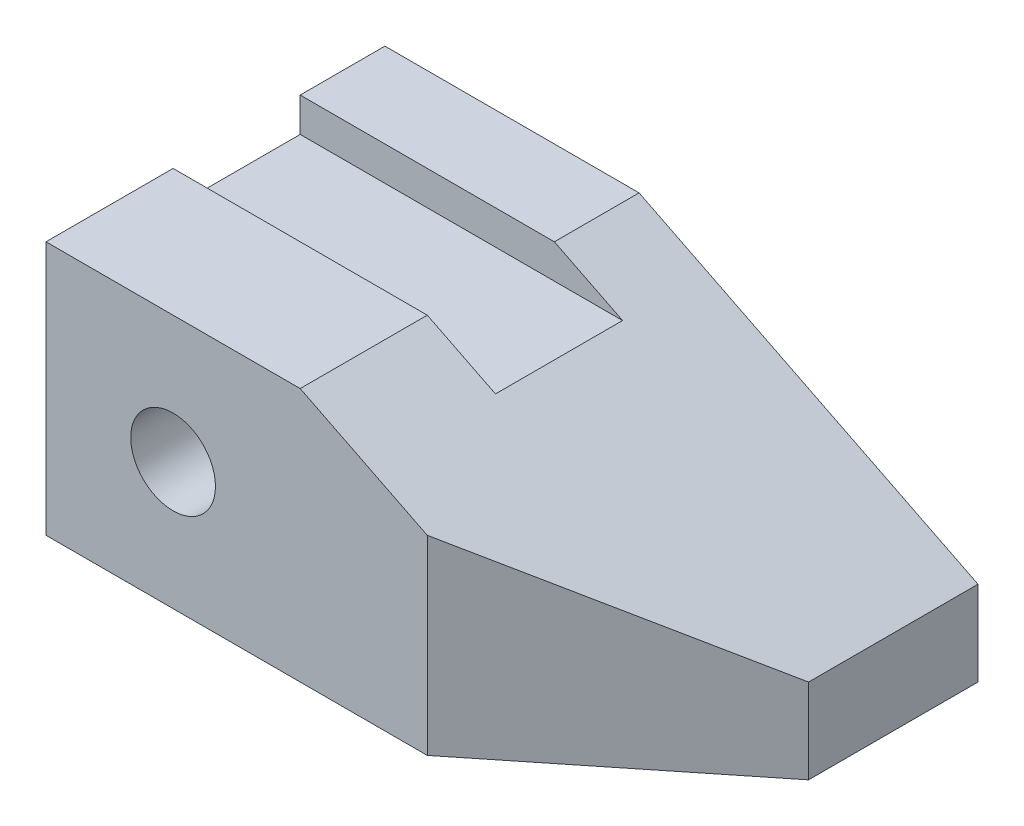
ISO-10303-21;
HEADER;
FILE_DESCRIPTION(('STEP AP214'),'2;1');
FILE_NAME('part.step','',(''),(''),'','','');
FILE_SCHEMA(('AUTOMOTIVE_DESIGN { 1 0 10303 214 1 1 1 1 }'));
ENDSEC;
DATA;
#1=APPLICATION_CONTEXT('core data for automotive mechanical design processes');
#2=APPLICATION_PROTOCOL_DEFINITION('international standard','automotive_design',2000,#1);
#3=PRODUCT_CONTEXT('',#1,'mechanical');
#4=PRODUCT('Part','Part','',(#3));
#5=PRODUCT_RELATED_PRODUCT_CATEGORY('part','',(#4));
#6=PRODUCT_DEFINITION_FORMATION('','',#4);
#7=PRODUCT_DEFINITION_CONTEXT('part definition',#1,'design');
#8=PRODUCT_DEFINITION('design','',#6,#7);
#9=PRODUCT_DEFINITION_SHAPE('','',#8);
#10=(LENGTH_UNIT() NAMED_UNIT(*) SI_UNIT(.MILLI.,.METRE.));
#11=(NAMED_UNIT(*) PLANE_ANGLE_UNIT() SI_UNIT($,.RADIAN.));
#12=(NAMED_UNIT(*) SI_UNIT($,.STERADIAN.) SOLID_ANGLE_UNIT());
#13=UNCERTAINTY_MEASURE_WITH_UNIT(LENGTH_MEASURE(1.E-05),#10,'distance_accuracy_value','');
#14=(GEOMETRIC_REPRESENTATION_CONTEXT(3) GLOBAL_UNCERTAINTY_ASSIGNED_CONTEXT((#13)) GLOBAL_UNIT_ASSIGNED_CONTEXT((#10,
#11,#12)) REPRESENTATION_CONTEXT('',''));
#15=CARTESIAN_POINT('',(0.,0.,0.));
#16=DIRECTION('',(0.,0.,1.));
#17=DIRECTION('',(1.,0.,0.));
#18=AXIS2_PLACEMENT_3D('',#15,#16,#17);
#19=CARTESIAN_POINT('',(0.,30.,0.));
#20=DIRECTION('',(0.,-1.,0.));
#21=DIRECTION('',(0.,0.,-1.));
#22=AXIS2_PLACEMENT_3D('',#19,#20,#21);
#23=PLANE('',#22);
#24=DIRECTION('',(0.,0.,1.));
#25=VECTOR('',#24,1.);
#26=CARTESIAN_POINT('',(0.,30.,0.));
#27=LINE('',#26,#25);
#28=CARTESIAN_POINT('',(0.,30.,-40.));
#29=VERTEX_POINT('',#28);
#30=CARTESIAN_POINT('',(0.,30.,-30.));
#31=VERTEX_POINT('',#30);
#32=EDGE_CURVE('E179',#29,#31,#27,.T.);
#33=ORIENTED_EDGE('',*,*,#32,.T.);
#34=DIRECTION('',(-1.,0.,0.));
#35=VECTOR('',#34,1.);
#36=CARTESIAN_POINT('',(70.,30.,-30.));
#37=LINE('',#36,#35);
#38=CARTESIAN_POINT('',(30.,30.,-30.));
#39=VERTEX_POINT('',#38);
#40=EDGE_CURVE('E131',#39,#31,#37,.T.);
#41=ORIENTED_EDGE('',*,*,#40,.F.);
#42=DIRECTION('',(0.,0.,1.));
#43=VECTOR('',#42,1.);
#44=CARTESIAN_POINT('',(30.,30.,-40.));
#45=LINE('',#44,#43);
#46=CARTESIAN_POINT('',(30.,30.,-40.));
#47=VERTEX_POINT('',#46);
#48=EDGE_CURVE('E175',#47,#39,#45,.T.);
#49=ORIENTED_EDGE('',*,*,#48,.F.);
#50=DIRECTION('',(-1.,0.,0.));
#51=VECTOR('',#50,1.);
#52=CARTESIAN_POINT('',(0.,30.,-40.));
#53=LINE('',#52,#51);
#54=EDGE_CURVE('E187',#47,#29,#53,.T.);
#55=ORIENTED_EDGE('',*,*,#54,.T.);
#56=EDGE_LOOP('',(#33,#41,#49,#55));
#57=FACE_BOUND('',#56,.T.);
#58=ADVANCED_FACE('F39',(#57),#23,.F.);
#59=CARTESIAN_POINT('',(0.,30.,0.));
#60=DIRECTION('',(1.,0.,0.));
#61=DIRECTION('',(0.,0.,-1.));
#62=AXIS2_PLACEMENT_3D('',#59,#60,#61);
#63=PLANE('',#62);
#64=DIRECTION('',(0.,0.,1.));
#65=VECTOR('',#64,1.);
#66=CARTESIAN_POINT('',(0.,25.9754682816031,-30.));
#67=LINE('',#66,#65);
#68=CARTESIAN_POINT('',(0.,25.9754682816031,-30.));
#69=VERTEX_POINT('',#68);
#70=CARTESIAN_POINT('',(0.,25.9754682816031,-15.));
#71=VERTEX_POINT('',#70);
#72=EDGE_CURVE('E119',#69,#71,#67,.T.);
#73=ORIENTED_EDGE('',*,*,#72,.F.);
#74=DIRECTION('',(0.,-1.,0.));
#75=VECTOR('',#74,1.);
#76=CARTESIAN_POINT('',(0.,30.,-30.));
#77=LINE('',#76,#75);
#78=EDGE_CURVE('E128',#31,#69,#77,.T.);
#79=ORIENTED_EDGE('',*,*,#78,.F.);
#80=ORIENTED_EDGE('',*,*,#32,.F.);
#81=DIRECTION('',(0.,-1.,0.));
#82=VECTOR('',#81,1.);
#83=CARTESIAN_POINT('',(0.,30.,-40.));
#84=LINE('',#83,#82);
#85=CARTESIAN_POINT('',(0.,0.,-40.));
#86=VERTEX_POINT('',#85);
#87=EDGE_CURVE('E190',#29,#86,#84,.T.);
#88=ORIENTED_EDGE('',*,*,#87,.T.);
#89=DIRECTION('',(0.,0.,1.));
#90=VECTOR('',#89,1.);
#91=CARTESIAN_POINT('',(0.,0.,0.));
#92=LINE('',#91,#90);
#93=CARTESIAN_POINT('',(0.,0.,0.));
#94=VERTEX_POINT('',#93);
#95=EDGE_CURVE('E174',#86,#94,#92,.T.);
#96=ORIENTED_EDGE('',*,*,#95,.T.);
#97=DIRECTION('',(0.,-1.,0.));
#98=VECTOR('',#97,1.);
#99=CARTESIAN_POINT('',(0.,30.,0.));
#100=LINE('',#99,#98);
#101=CARTESIAN_POINT('',(0.,30.,0.));
#102=VERTEX_POINT('',#101);
#103=EDGE_CURVE('E211',#102,#94,#100,.T.);
#104=ORIENTED_EDGE('',*,*,#103,.F.);
#105=CARTESIAN_POINT('',(0.,30.,-15.));
#106=VERTEX_POINT('',#105);
#107=EDGE_CURVE('E183',#106,#102,#27,.T.);
#108=ORIENTED_EDGE('',*,*,#107,.F.);
#109=DIRECTION('',(0.,1.,0.));
#110=VECTOR('',#109,1.);
#111=CARTESIAN_POINT('',(0.,30.,-15.));
#112=LINE('',#111,#110);
#113=EDGE_CURVE('E125',#71,#106,#112,.T.);
#114=ORIENTED_EDGE('',*,*,#113,.F.);
#115=EDGE_LOOP('',(#73,#79,#80,#88,#96,#104,#108,#114));
#116=FACE_BOUND('',#115,.T.);
#117=ADVANCED_FACE('F41',(#116),#63,.F.);
#118=CARTESIAN_POINT('',(0.,30.,0.));
#119=DIRECTION('',(0.,0.,-1.));
#120=DIRECTION('',(-1.,0.,0.));
#121=AXIS2_PLACEMENT_3D('',#118,#119,#120);
#122=PLANE('',#121);
#123=CARTESIAN_POINT('',(15.,15.,0.));
#124=DIRECTION('',(0.,0.,1.));
#125=DIRECTION('',(1.,0.,0.));
#126=AXIS2_PLACEMENT_3D('',#123,#124,#125);
#127=CIRCLE('',#126,5.);
#128=CARTESIAN_POINT('',(20.,15.,0.));
#129=VERTEX_POINT('',#128);
#130=EDGE_CURVE('E275',#129,#129,#127,.T.);
#131=ORIENTED_EDGE('',*,*,#130,.F.);
#132=EDGE_LOOP('',(#131));
#133=FACE_BOUND('',#132,.T.);
#134=DIRECTION('',(1.,0.,0.));
#135=VECTOR('',#134,1.);
#136=CARTESIAN_POINT('',(0.,0.,0.));
#137=LINE('',#136,#135);
#138=CARTESIAN_POINT('',(45.,0.,0.));
#139=VERTEX_POINT('',#138);
#140=EDGE_CURVE('E194',#94,#139,#137,.T.);
#141=ORIENTED_EDGE('',*,*,#140,.T.);
#142=DIRECTION('',(0.,-1.,0.));
#143=VECTOR('',#142,1.);
#144=CARTESIAN_POINT('',(45.,30.,0.));
#145=LINE('',#144,#143);
#146=CARTESIAN_POINT('',(45.,22.5,0.));
#147=VERTEX_POINT('',#146);
#148=EDGE_CURVE('E156',#147,#139,#145,.T.);
#149=ORIENTED_EDGE('',*,*,#148,.F.);
#150=DIRECTION('',(0.894427190999916,-0.447213595499958,0.));
#151=VECTOR('',#150,1.);
#152=CARTESIAN_POINT('',(30.,30.,0.));
#153=LINE('',#152,#151);
#154=CARTESIAN_POINT('',(30.,30.,0.));
#155=VERTEX_POINT('',#154);
#156=EDGE_CURVE('E159',#155,#147,#153,.T.);
#157=ORIENTED_EDGE('',*,*,#156,.F.);
#158=DIRECTION('',(1.,0.,0.));
#159=VECTOR('',#158,1.);
#160=CARTESIAN_POINT('',(0.,30.,0.));
#161=LINE('',#160,#159);
#162=EDGE_CURVE('E182',#102,#155,#161,.T.);
#163=ORIENTED_EDGE('',*,*,#162,.F.);
#164=ORIENTED_EDGE('',*,*,#103,.T.);
#165=EDGE_LOOP('',(#141,#149,#157,#163,#164));
#166=FACE_BOUND('',#165,.T.);
#167=ADVANCED_FACE('F233',(#133,#166),#122,.F.);
#168=CARTESIAN_POINT('',(70.,30.,0.));
#169=DIRECTION('',(-1.,0.,0.));
#170=DIRECTION('',(0.,0.,1.));
#171=AXIS2_PLACEMENT_3D('',#168,#169,#170);
#172=PLANE('',#171);
#173=DIRECTION('',(0.,0.,1.));
#174=VECTOR('',#173,1.);
#175=CARTESIAN_POINT('',(70.,10.,-40.));
#176=LINE('',#175,#174);
#177=CARTESIAN_POINT('',(70.,10.,-40.));
#178=VERTEX_POINT('',#177);
#179=CARTESIAN_POINT('',(70.,9.99999999999999,-20.));
#180=VERTEX_POINT('',#179);
#181=EDGE_CURVE('E170',#178,#180,#176,.T.);
#182=ORIENTED_EDGE('',*,*,#181,.T.);
#183=DIRECTION('',(0.,-1.,0.));
#184=VECTOR('',#183,1.);
#185=CARTESIAN_POINT('',(70.,30.,-20.));
#186=LINE('',#185,#184);
#187=CARTESIAN_POINT('',(70.,0.,-20.));
#188=VERTEX_POINT('',#187);
#189=EDGE_CURVE('E63',#180,#188,#186,.T.);
#190=ORIENTED_EDGE('',*,*,#189,.T.);
#191=DIRECTION('',(0.,0.,-1.));
#192=VECTOR('',#191,1.);
#193=CARTESIAN_POINT('',(70.,0.,0.));
#194=LINE('',#193,#192);
#195=CARTESIAN_POINT('',(70.,0.,-40.));
#196=VERTEX_POINT('',#195);
#197=EDGE_CURVE('E198',#188,#196,#194,.T.);
#198=ORIENTED_EDGE('',*,*,#197,.T.);
#199=DIRECTION('',(0.,-1.,0.));
#200=VECTOR('',#199,1.);
#201=CARTESIAN_POINT('',(70.,30.,-40.));
#202=LINE('',#201,#200);
#203=EDGE_CURVE('E207',#178,#196,#202,.T.);
#204=ORIENTED_EDGE('',*,*,#203,.F.);
#205=EDGE_LOOP('',(#182,#190,#198,#204));
#206=FACE_BOUND('',#205,.T.);
#207=ADVANCED_FACE('F244',(#206),#172,.F.);
#208=CARTESIAN_POINT('',(0.,30.,-40.));
#209=DIRECTION('',(0.,0.,1.));
#210=DIRECTION('',(1.,0.,0.));
#211=AXIS2_PLACEMENT_3D('',#208,#209,#210);
#212=PLANE('',#211);
#213=CARTESIAN_POINT('',(15.,15.,-40.));
#214=DIRECTION('',(0.,0.,1.));
#215=DIRECTION('',(1.,0.,0.));
#216=AXIS2_PLACEMENT_3D('',#213,#214,#215);
#217=CIRCLE('',#216,5.);
#218=CARTESIAN_POINT('',(20.,15.,-40.));
#219=VERTEX_POINT('',#218);
#220=EDGE_CURVE('E136',#219,#219,#217,.T.);
#221=ORIENTED_EDGE('',*,*,#220,.T.);
#222=EDGE_LOOP('',(#221));
#223=FACE_BOUND('',#222,.T.);
#224=ORIENTED_EDGE('',*,*,#54,.F.);
#225=DIRECTION('',(0.894427190999916,-0.447213595499958,0.));
#226=VECTOR('',#225,1.);
#227=CARTESIAN_POINT('',(30.,30.,-40.));
#228=LINE('',#227,#226);
#229=EDGE_CURVE('E162',#47,#178,#228,.T.);
#230=ORIENTED_EDGE('',*,*,#229,.T.);
#231=ORIENTED_EDGE('',*,*,#203,.T.);
#232=DIRECTION('',(-1.,0.,0.));
#233=VECTOR('',#232,1.);
#234=CARTESIAN_POINT('',(0.,0.,-40.));
#235=LINE('',#234,#233);
#236=EDGE_CURVE('E201',#196,#86,#235,.T.);
#237=ORIENTED_EDGE('',*,*,#236,.T.);
#238=ORIENTED_EDGE('',*,*,#87,.F.);
#239=EDGE_LOOP('',(#224,#230,#231,#237,#238));
#240=FACE_BOUND('',#239,.T.);
#241=ADVANCED_FACE('F247',(#223,#240),#212,.F.);
#242=CARTESIAN_POINT('',(30.,30.,-15.));
#243=VERTEX_POINT('',#242);
#244=EDGE_CURVE('E166',#243,#155,#45,.T.);
#245=ORIENTED_EDGE('',*,*,#244,.F.);
#246=DIRECTION('',(-1.,0.,0.));
#247=VECTOR('',#246,1.);
#248=CARTESIAN_POINT('',(70.,30.,-15.));
#249=LINE('',#248,#247);
#250=EDGE_CURVE('E148',#243,#106,#249,.T.);
#251=ORIENTED_EDGE('',*,*,#250,.T.);
#252=ORIENTED_EDGE('',*,*,#107,.T.);
#253=ORIENTED_EDGE('',*,*,#162,.T.);
#254=EDGE_LOOP('',(#245,#251,#252,#253));
#255=FACE_BOUND('',#254,.T.);
#256=ADVANCED_FACE('F227',(#255),#23,.F.);
#257=CARTESIAN_POINT('',(0.,0.,0.));
#258=DIRECTION('',(0.,-1.,0.));
#259=DIRECTION('',(0.,0.,-1.));
#260=AXIS2_PLACEMENT_3D('',#257,#258,#259);
#261=PLANE('',#260);
#262=DIRECTION('',(0.78086880944303,0.,-0.624695047554424));
#263=VECTOR('',#262,1.);
#264=CARTESIAN_POINT('',(45.,0.,0.));
#265=LINE('',#264,#263);
#266=EDGE_CURVE('E147',#139,#188,#265,.T.);
#267=ORIENTED_EDGE('',*,*,#266,.F.);
#268=ORIENTED_EDGE('',*,*,#140,.F.);
#269=ORIENTED_EDGE('',*,*,#95,.F.);
#270=ORIENTED_EDGE('',*,*,#236,.F.);
#271=ORIENTED_EDGE('',*,*,#197,.F.);
#272=EDGE_LOOP('',(#267,#268,#269,#270,#271));
#273=FACE_BOUND('',#272,.T.);
#274=ADVANCED_FACE('F240',(#273),#261,.T.);
#275=CARTESIAN_POINT('',(30.,30.,-40.));
#276=DIRECTION('',(-0.447213595499958,-0.894427190999916,0.));
#277=DIRECTION('',(0.894427190999916,-0.447213595499958,0.));
#278=AXIS2_PLACEMENT_3D('',#275,#276,#277);
#279=PLANE('',#278);
#280=ORIENTED_EDGE('',*,*,#48,.T.);
#281=DIRECTION('',(0.894427190999916,-0.447213595499958,0.));
#282=VECTOR('',#281,1.);
#283=CARTESIAN_POINT('',(30.,30.,-30.));
#284=LINE('',#283,#282);
#285=CARTESIAN_POINT('',(38.0490634367938,25.9754682816031,-30.));
#286=VERTEX_POINT('',#285);
#287=EDGE_CURVE('E11',#39,#286,#284,.T.);
#288=ORIENTED_EDGE('',*,*,#287,.T.);
#289=DIRECTION('',(0.,0.,1.));
#290=VECTOR('',#289,1.);
#291=CARTESIAN_POINT('',(38.0490634367938,25.9754682816031,-40.));
#292=LINE('',#291,#290);
#293=CARTESIAN_POINT('',(38.0490634367938,25.9754682816031,-15.));
#294=VERTEX_POINT('',#293);
#295=EDGE_CURVE('E122',#286,#294,#292,.T.);
#296=ORIENTED_EDGE('',*,*,#295,.T.);
#297=DIRECTION('',(-0.894427190999916,0.447213595499958,0.));
#298=VECTOR('',#297,1.);
#299=CARTESIAN_POINT('',(30.,30.,-15.));
#300=LINE('',#299,#298);
#301=EDGE_CURVE('E48',#294,#243,#300,.T.);
#302=ORIENTED_EDGE('',*,*,#301,.T.);
#303=ORIENTED_EDGE('',*,*,#244,.T.);
#304=ORIENTED_EDGE('',*,*,#156,.T.);
#305=DIRECTION('',(0.727392967453308,-0.363696483726654,-0.581914373962646));
#306=VECTOR('',#305,1.);
#307=CARTESIAN_POINT('',(52.010582010582,18.994708994709,-5.6084656084656));
#308=LINE('',#307,#306);
#309=EDGE_CURVE('E215',#147,#180,#308,.T.);
#310=ORIENTED_EDGE('',*,*,#309,.T.);
#311=ORIENTED_EDGE('',*,*,#181,.F.);
#312=ORIENTED_EDGE('',*,*,#229,.F.);
#313=EDGE_LOOP('',(#280,#288,#296,#302,#303,#304,#310,#311,#312));
#314=FACE_BOUND('',#313,.T.);
#315=ADVANCED_FACE('F223',(#314),#279,.F.);
#316=CARTESIAN_POINT('',(45.,30.,0.));
#317=DIRECTION('',(-0.624695047554424,0.,-0.78086880944303));
#318=DIRECTION('',(-0.78086880944303,0.,0.624695047554424));
#319=AXIS2_PLACEMENT_3D('',#316,#317,#318);
#320=PLANE('',#319);
#321=ORIENTED_EDGE('',*,*,#148,.T.);
#322=ORIENTED_EDGE('',*,*,#266,.T.);
#323=ORIENTED_EDGE('',*,*,#189,.F.);
#324=ORIENTED_EDGE('',*,*,#309,.F.);
#325=EDGE_LOOP('',(#321,#322,#323,#324));
#326=FACE_BOUND('',#325,.T.);
#327=ADVANCED_FACE('F295',(#326),#320,.F.);
#328=CARTESIAN_POINT('',(70.,30.,-30.));
#329=DIRECTION('',(0.,0.,-1.));
#330=DIRECTION('',(-1.,0.,0.));
#331=AXIS2_PLACEMENT_3D('',#328,#329,#330);
#332=PLANE('',#331);
#333=ORIENTED_EDGE('',*,*,#40,.T.);
#334=ORIENTED_EDGE('',*,*,#78,.T.);
#335=DIRECTION('',(-1.,0.,0.));
#336=VECTOR('',#335,1.);
#337=CARTESIAN_POINT('',(70.,25.9754682816031,-30.));
#338=LINE('',#337,#336);
#339=EDGE_CURVE('E115',#286,#69,#338,.T.);
#340=ORIENTED_EDGE('',*,*,#339,.F.);
#341=ORIENTED_EDGE('',*,*,#287,.F.);
#342=EDGE_LOOP('',(#333,#334,#340,#341));
#343=FACE_BOUND('',#342,.T.);
#344=ADVANCED_FACE('F129',(#343),#332,.F.);
#345=CARTESIAN_POINT('',(70.,30.,-15.));
#346=DIRECTION('',(0.,0.,1.));
#347=DIRECTION('',(1.,0.,0.));
#348=AXIS2_PLACEMENT_3D('',#345,#346,#347);
#349=PLANE('',#348);
#350=DIRECTION('',(-1.,0.,0.));
#351=VECTOR('',#350,1.);
#352=CARTESIAN_POINT('',(70.,25.9754682816031,-15.));
#353=LINE('',#352,#351);
#354=EDGE_CURVE('E55',#294,#71,#353,.T.);
#355=ORIENTED_EDGE('',*,*,#354,.T.);
#356=ORIENTED_EDGE('',*,*,#113,.T.);
#357=ORIENTED_EDGE('',*,*,#250,.F.);
#358=ORIENTED_EDGE('',*,*,#301,.F.);
#359=EDGE_LOOP('',(#355,#356,#357,#358));
#360=FACE_BOUND('',#359,.T.);
#361=ADVANCED_FACE('F288',(#360),#349,.F.);
#362=CARTESIAN_POINT('',(70.,25.9754682816031,-30.));
#363=DIRECTION('',(0.,-1.,0.));
#364=DIRECTION('',(0.,0.,-1.));
#365=AXIS2_PLACEMENT_3D('',#362,#363,#364);
#366=PLANE('',#365);
#367=ORIENTED_EDGE('',*,*,#339,.T.);
#368=ORIENTED_EDGE('',*,*,#72,.T.);
#369=ORIENTED_EDGE('',*,*,#354,.F.);
#370=ORIENTED_EDGE('',*,*,#295,.F.);
#371=EDGE_LOOP('',(#367,#368,#369,#370));
#372=FACE_BOUND('',#371,.T.);
#373=ADVANCED_FACE('F117',(#372),#366,.F.);
#374=CARTESIAN_POINT('',(15.,15.,-40.));
#375=DIRECTION('',(0.,0.,1.));
#376=DIRECTION('',(1.,0.,0.));
#377=AXIS2_PLACEMENT_3D('',#374,#375,#376);
#378=CYLINDRICAL_SURFACE('',#377,5.);
#379=ORIENTED_EDGE('',*,*,#220,.F.);
#380=EDGE_LOOP('',(#379));
#381=FACE_BOUND('',#380,.T.);
#382=ORIENTED_EDGE('',*,*,#130,.T.);
#383=EDGE_LOOP('',(#382));
#384=FACE_BOUND('',#383,.T.);
#385=ADVANCED_FACE('F282',(#381,#384),#378,.F.);
#386=CLOSED_SHELL('',(#58,#117,#167,#207,#241,#256,#274,#315,#327,#344,#361,#373,#385));
#387=MANIFOLD_SOLID_BREP('B2',#386);
#388=ADVANCED_BREP_SHAPE_REPRESENTATION('',(#18,#387),#14);
#389=SHAPE_DEFINITION_REPRESENTATION(#9,#388);
ENDSEC;
END-ISO-10303-21;
